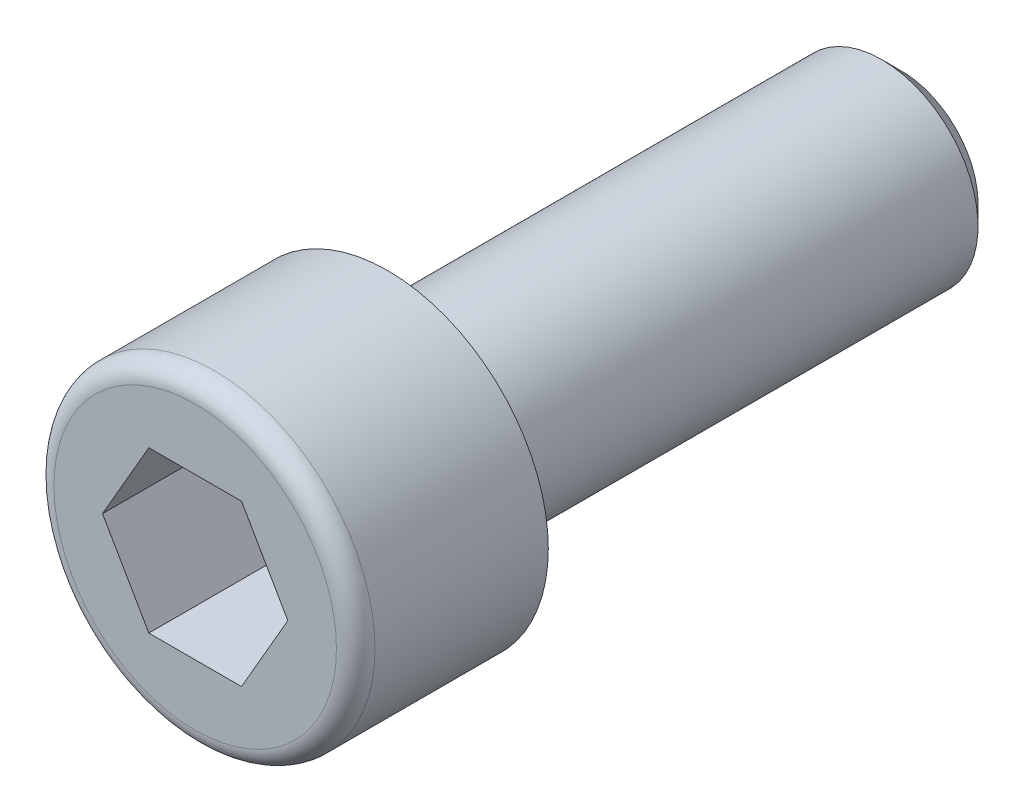
ISO-10303-21;
HEADER;
FILE_DESCRIPTION(('STEP AP214'),'2;1');
FILE_NAME('part.step','',(''),(''),'','','');
FILE_SCHEMA(('AUTOMOTIVE_DESIGN { 1 0 10303 214 1 1 1 1 }'));
ENDSEC;
DATA;
#1=APPLICATION_CONTEXT('core data for automotive mechanical design processes');
#2=APPLICATION_PROTOCOL_DEFINITION('international standard','automotive_design',2000,#1);
#3=PRODUCT_CONTEXT('',#1,'mechanical');
#4=PRODUCT('Part','Part','',(#3));
#5=PRODUCT_RELATED_PRODUCT_CATEGORY('part','',(#4));
#6=PRODUCT_DEFINITION_FORMATION('','',#4);
#7=PRODUCT_DEFINITION_CONTEXT('part definition',#1,'design');
#8=PRODUCT_DEFINITION('design','',#6,#7);
#9=PRODUCT_DEFINITION_SHAPE('','',#8);
#10=(LENGTH_UNIT() NAMED_UNIT(*) SI_UNIT(.MILLI.,.METRE.));
#11=(NAMED_UNIT(*) PLANE_ANGLE_UNIT() SI_UNIT($,.RADIAN.));
#12=(NAMED_UNIT(*) SI_UNIT($,.STERADIAN.) SOLID_ANGLE_UNIT());
#13=UNCERTAINTY_MEASURE_WITH_UNIT(LENGTH_MEASURE(1.E-05),#10,'distance_accuracy_value','');
#14=(GEOMETRIC_REPRESENTATION_CONTEXT(3) GLOBAL_UNCERTAINTY_ASSIGNED_CONTEXT((#13)) GLOBAL_UNIT_ASSIGNED_CONTEXT((#10,
#11,#12)) REPRESENTATION_CONTEXT('',''));
#15=CARTESIAN_POINT('',(0.,0.,0.));
#16=DIRECTION('',(0.,0.,1.));
#17=DIRECTION('',(1.,0.,0.));
#18=AXIS2_PLACEMENT_3D('',#15,#16,#17);
#19=CARTESIAN_POINT('',(0.,0.,1.34877823011767));
#20=DIRECTION('',(0.,0.,-1.));
#21=DIRECTION('',(0.,1.,0.));
#22=AXIS2_PLACEMENT_3D('',#19,#20,#21);
#23=PLANE('',#22);
#24=DIRECTION('',(0.500000000000001,-0.866025403784438,0.));
#25=VECTOR('',#24,1.);
#26=CARTESIAN_POINT('',(2.1650635094611,1.25,1.34877823011767));
#27=LINE('',#26,#25);
#28=CARTESIAN_POINT('',(1.44337567297406,2.5,1.34877823011767));
#29=VERTEX_POINT('',#28);
#30=CARTESIAN_POINT('',(2.88675134594813,0.,1.34877823011767));
#31=VERTEX_POINT('',#30);
#32=EDGE_CURVE('E72',#29,#31,#27,.T.);
#33=ORIENTED_EDGE('',*,*,#32,.F.);
#34=DIRECTION('',(1.,0.,0.));
#35=VECTOR('',#34,1.);
#36=CARTESIAN_POINT('',(0.,2.5,1.34877823011767));
#37=LINE('',#36,#35);
#38=CARTESIAN_POINT('',(-1.44337567297406,2.5,1.34877823011767));
#39=VERTEX_POINT('',#38);
#40=EDGE_CURVE('E221',#39,#29,#37,.T.);
#41=ORIENTED_EDGE('',*,*,#40,.F.);
#42=DIRECTION('',(0.5,0.866025403784439,0.));
#43=VECTOR('',#42,1.);
#44=CARTESIAN_POINT('',(-2.1650635094611,1.25,1.34877823011767));
#45=LINE('',#44,#43);
#46=CARTESIAN_POINT('',(-2.88675134594813,0.,1.34877823011767));
#47=VERTEX_POINT('',#46);
#48=EDGE_CURVE('E224',#47,#39,#45,.T.);
#49=ORIENTED_EDGE('',*,*,#48,.F.);
#50=DIRECTION('',(-0.500000000000001,0.866025403784438,0.));
#51=VECTOR('',#50,1.);
#52=CARTESIAN_POINT('',(-2.1650635094611,-1.25,1.34877823011767));
#53=LINE('',#52,#51);
#54=CARTESIAN_POINT('',(-1.44337567297406,-2.5,1.34877823011767));
#55=VERTEX_POINT('',#54);
#56=EDGE_CURVE('E229',#55,#47,#53,.T.);
#57=ORIENTED_EDGE('',*,*,#56,.F.);
#58=DIRECTION('',(1.,0.,0.));
#59=VECTOR('',#58,1.);
#60=CARTESIAN_POINT('',(0.,-2.5,1.34877823011767));
#61=LINE('',#60,#59);
#62=CARTESIAN_POINT('',(1.44337567297406,-2.5,1.34877823011767));
#63=VERTEX_POINT('',#62);
#64=EDGE_CURVE('E83',#63,#55,#61,.F.);
#65=ORIENTED_EDGE('',*,*,#64,.F.);
#66=DIRECTION('',(-0.5,-0.866025403784439,0.));
#67=VECTOR('',#66,1.);
#68=CARTESIAN_POINT('',(2.1650635094611,-1.25,1.34877823011767));
#69=LINE('',#68,#67);
#70=EDGE_CURVE('E67',#31,#63,#69,.T.);
#71=ORIENTED_EDGE('',*,*,#70,.F.);
#72=EDGE_LOOP('',(#33,#41,#49,#57,#65,#71));
#73=FACE_BOUND('',#72,.T.);
#74=ADVANCED_FACE('F17',(#73),#23,.F.);
#75=CARTESIAN_POINT('',(2.1650635094611,1.25,3.67438911505884));
#76=DIRECTION('',(-0.866025403784438,-0.500000000000001,0.));
#77=DIRECTION('',(0.500000000000001,-0.866025403784438,0.));
#78=AXIS2_PLACEMENT_3D('',#75,#76,#77);
#79=PLANE('',#78);
#80=DIRECTION('',(0.,0.,1.));
#81=VECTOR('',#80,1.);
#82=CARTESIAN_POINT('',(2.88675134594813,0.,3.67438911505883));
#83=LINE('',#82,#81);
#84=CARTESIAN_POINT('',(2.88675134594813,0.,6.));
#85=VERTEX_POINT('',#84);
#86=EDGE_CURVE('E74',#85,#31,#83,.F.);
#87=ORIENTED_EDGE('',*,*,#86,.F.);
#88=DIRECTION('',(0.5,-0.866025403784439,0.));
#89=VECTOR('',#88,1.);
#90=CARTESIAN_POINT('',(1.44337567297406,2.5,6.));
#91=LINE('',#90,#89);
#92=CARTESIAN_POINT('',(1.44337567297406,2.5,6.));
#93=VERTEX_POINT('',#92);
#94=EDGE_CURVE('E210',#93,#85,#91,.T.);
#95=ORIENTED_EDGE('',*,*,#94,.F.);
#96=DIRECTION('',(0.,0.,-1.));
#97=VECTOR('',#96,1.);
#98=CARTESIAN_POINT('',(1.44337567297406,2.5,3.67438911505884));
#99=LINE('',#98,#97);
#100=EDGE_CURVE('E77',#29,#93,#99,.F.);
#101=ORIENTED_EDGE('',*,*,#100,.F.);
#102=ORIENTED_EDGE('',*,*,#32,.T.);
#103=EDGE_LOOP('',(#87,#95,#101,#102));
#104=FACE_BOUND('',#103,.T.);
#105=ADVANCED_FACE('F73',(#104),#79,.T.);
#106=CARTESIAN_POINT('',(2.1650635094611,-1.25,3.67438911505883));
#107=DIRECTION('',(-0.866025403784439,0.5,0.));
#108=DIRECTION('',(-0.5,-0.866025403784439,0.));
#109=AXIS2_PLACEMENT_3D('',#106,#107,#108);
#110=PLANE('',#109);
#111=DIRECTION('',(0.,0.,1.));
#112=VECTOR('',#111,1.);
#113=CARTESIAN_POINT('',(1.44337567297406,-2.5,3.67438911505884));
#114=LINE('',#113,#112);
#115=CARTESIAN_POINT('',(1.44337567297407,-2.5,6.));
#116=VERTEX_POINT('',#115);
#117=EDGE_CURVE('E85',#116,#63,#114,.F.);
#118=ORIENTED_EDGE('',*,*,#117,.F.);
#119=DIRECTION('',(-0.5,-0.866025403784439,0.));
#120=VECTOR('',#119,1.);
#121=CARTESIAN_POINT('',(2.88675134594813,0.,6.));
#122=LINE('',#121,#120);
#123=EDGE_CURVE('E89',#85,#116,#122,.T.);
#124=ORIENTED_EDGE('',*,*,#123,.F.);
#125=ORIENTED_EDGE('',*,*,#86,.T.);
#126=ORIENTED_EDGE('',*,*,#70,.T.);
#127=EDGE_LOOP('',(#118,#124,#125,#126));
#128=FACE_BOUND('',#127,.T.);
#129=ADVANCED_FACE('F87',(#128),#110,.T.);
#130=CARTESIAN_POINT('',(0.,-2.5,3.67438911505884));
#131=DIRECTION('',(0.,1.,0.));
#132=DIRECTION('',(0.,0.,1.));
#133=AXIS2_PLACEMENT_3D('',#130,#131,#132);
#134=PLANE('',#133);
#135=DIRECTION('',(0.,0.,1.));
#136=VECTOR('',#135,1.);
#137=CARTESIAN_POINT('',(-1.44337567297406,-2.5,3.67438911505884));
#138=LINE('',#137,#136);
#139=CARTESIAN_POINT('',(-1.44337567297406,-2.5,6.));
#140=VERTEX_POINT('',#139);
#141=EDGE_CURVE('E231',#140,#55,#138,.F.);
#142=ORIENTED_EDGE('',*,*,#141,.F.);
#143=DIRECTION('',(1.,0.,0.));
#144=VECTOR('',#143,1.);
#145=CARTESIAN_POINT('',(0.,-2.5,6.));
#146=LINE('',#145,#144);
#147=EDGE_CURVE('E236',#116,#140,#146,.F.);
#148=ORIENTED_EDGE('',*,*,#147,.F.);
#149=ORIENTED_EDGE('',*,*,#117,.T.);
#150=ORIENTED_EDGE('',*,*,#64,.T.);
#151=EDGE_LOOP('',(#142,#148,#149,#150));
#152=FACE_BOUND('',#151,.T.);
#153=ADVANCED_FACE('F149',(#152),#134,.T.);
#154=CARTESIAN_POINT('',(-2.1650635094611,-1.25,3.67438911505884));
#155=DIRECTION('',(0.866025403784438,0.500000000000001,0.));
#156=DIRECTION('',(-0.500000000000001,0.866025403784438,0.));
#157=AXIS2_PLACEMENT_3D('',#154,#155,#156);
#158=PLANE('',#157);
#159=DIRECTION('',(0.,0.,1.));
#160=VECTOR('',#159,1.);
#161=CARTESIAN_POINT('',(-2.88675134594813,0.,3.67438911505884));
#162=LINE('',#161,#160);
#163=CARTESIAN_POINT('',(-2.88675134594813,0.,6.));
#164=VERTEX_POINT('',#163);
#165=EDGE_CURVE('E226',#164,#47,#162,.F.);
#166=ORIENTED_EDGE('',*,*,#165,.F.);
#167=DIRECTION('',(-0.5,0.866025403784439,0.));
#168=VECTOR('',#167,1.);
#169=CARTESIAN_POINT('',(-1.44337567297406,-2.5,6.));
#170=LINE('',#169,#168);
#171=EDGE_CURVE('E240',#140,#164,#170,.T.);
#172=ORIENTED_EDGE('',*,*,#171,.F.);
#173=ORIENTED_EDGE('',*,*,#141,.T.);
#174=ORIENTED_EDGE('',*,*,#56,.T.);
#175=EDGE_LOOP('',(#166,#172,#173,#174));
#176=FACE_BOUND('',#175,.T.);
#177=ADVANCED_FACE('F146',(#176),#158,.T.);
#178=CARTESIAN_POINT('',(-2.1650635094611,1.25,3.67438911505884));
#179=DIRECTION('',(0.866025403784439,-0.5,0.));
#180=DIRECTION('',(0.5,0.866025403784439,0.));
#181=AXIS2_PLACEMENT_3D('',#178,#179,#180);
#182=PLANE('',#181);
#183=DIRECTION('',(0.,0.,-1.));
#184=VECTOR('',#183,1.);
#185=CARTESIAN_POINT('',(-1.44337567297406,2.5,3.67438911505884));
#186=LINE('',#185,#184);
#187=CARTESIAN_POINT('',(-1.44337567297406,2.5,6.));
#188=VERTEX_POINT('',#187);
#189=EDGE_CURVE('E35',#188,#39,#186,.T.);
#190=ORIENTED_EDGE('',*,*,#189,.F.);
#191=DIRECTION('',(0.499999999999999,0.866025403784439,0.));
#192=VECTOR('',#191,1.);
#193=CARTESIAN_POINT('',(-2.88675134594813,0.,6.));
#194=LINE('',#193,#192);
#195=EDGE_CURVE('E245',#164,#188,#194,.T.);
#196=ORIENTED_EDGE('',*,*,#195,.F.);
#197=ORIENTED_EDGE('',*,*,#165,.T.);
#198=ORIENTED_EDGE('',*,*,#48,.T.);
#199=EDGE_LOOP('',(#190,#196,#197,#198));
#200=FACE_BOUND('',#199,.T.);
#201=ADVANCED_FACE('F142',(#200),#182,.T.);
#202=CARTESIAN_POINT('',(0.,2.5,3.67438911505884));
#203=DIRECTION('',(0.,-1.,0.));
#204=DIRECTION('',(0.,0.,-1.));
#205=AXIS2_PLACEMENT_3D('',#202,#203,#204);
#206=PLANE('',#205);
#207=ORIENTED_EDGE('',*,*,#100,.T.);
#208=DIRECTION('',(1.,0.,0.));
#209=VECTOR('',#208,1.);
#210=CARTESIAN_POINT('',(0.,2.5,6.));
#211=LINE('',#210,#209);
#212=EDGE_CURVE('E114',#188,#93,#211,.T.);
#213=ORIENTED_EDGE('',*,*,#212,.F.);
#214=ORIENTED_EDGE('',*,*,#189,.T.);
#215=ORIENTED_EDGE('',*,*,#40,.T.);
#216=EDGE_LOOP('',(#207,#213,#214,#215));
#217=FACE_BOUND('',#216,.T.);
#218=ADVANCED_FACE('F137',(#217),#206,.T.);
#219=CARTESIAN_POINT('',(0.,0.,6.));
#220=DIRECTION('',(0.,0.,1.));
#221=DIRECTION('',(0.,-1.,0.));
#222=AXIS2_PLACEMENT_3D('',#219,#220,#221);
#223=PLANE('',#222);
#224=CARTESIAN_POINT('',(0.,0.,6.));
#225=DIRECTION('',(0.,0.,-1.));
#226=DIRECTION('',(1.,0.,0.));
#227=AXIS2_PLACEMENT_3D('',#224,#225,#226);
#228=CIRCLE('',#227,4.4);
#229=CARTESIAN_POINT('',(4.4,0.,6.));
#230=VERTEX_POINT('',#229);
#231=EDGE_CURVE('E109',#230,#230,#228,.T.);
#232=ORIENTED_EDGE('',*,*,#231,.F.);
#233=EDGE_LOOP('',(#232));
#234=FACE_BOUND('',#233,.T.);
#235=ORIENTED_EDGE('',*,*,#195,.T.);
#236=ORIENTED_EDGE('',*,*,#212,.T.);
#237=ORIENTED_EDGE('',*,*,#94,.T.);
#238=ORIENTED_EDGE('',*,*,#123,.T.);
#239=ORIENTED_EDGE('',*,*,#147,.T.);
#240=ORIENTED_EDGE('',*,*,#171,.T.);
#241=EDGE_LOOP('',(#235,#236,#237,#238,#239,#240));
#242=FACE_BOUND('',#241,.T.);
#243=ADVANCED_FACE('F126',(#234,#242),#223,.T.);
#244=CARTESIAN_POINT('',(0.,0.,5.4));
#245=DIRECTION('',(0.,0.,-1.));
#246=DIRECTION('',(1.,0.,0.));
#247=AXIS2_PLACEMENT_3D('',#244,#245,#246);
#248=TOROIDAL_SURFACE('',#247,4.4,0.6);
#249=CARTESIAN_POINT('',(0.,0.,5.4));
#250=DIRECTION('',(0.,0.,-1.));
#251=DIRECTION('',(0.,1.,0.));
#252=AXIS2_PLACEMENT_3D('',#249,#250,#251);
#253=CIRCLE('',#252,5.);
#254=CARTESIAN_POINT('',(0.,5.,5.4));
#255=VERTEX_POINT('',#254);
#256=EDGE_CURVE('E105',#255,#255,#253,.T.);
#257=ORIENTED_EDGE('',*,*,#256,.F.);
#258=EDGE_LOOP('',(#257));
#259=FACE_BOUND('',#258,.T.);
#260=ORIENTED_EDGE('',*,*,#231,.T.);
#261=EDGE_LOOP('',(#260));
#262=FACE_BOUND('',#261,.T.);
#263=ADVANCED_FACE('F136',(#259,#262),#248,.T.);
#264=CARTESIAN_POINT('',(0.,0.,2.7));
#265=DIRECTION('',(0.,0.,-1.));
#266=DIRECTION('',(0.,1.,0.));
#267=AXIS2_PLACEMENT_3D('',#264,#265,#266);
#268=CYLINDRICAL_SURFACE('',#267,5.);
#269=CARTESIAN_POINT('',(0.,0.,0.));
#270=DIRECTION('',(0.,0.,-1.));
#271=DIRECTION('',(0.,1.,0.));
#272=AXIS2_PLACEMENT_3D('',#269,#270,#271);
#273=CIRCLE('',#272,5.);
#274=CARTESIAN_POINT('',(0.,5.,0.));
#275=VERTEX_POINT('',#274);
#276=EDGE_CURVE('E20',#275,#275,#273,.T.);
#277=ORIENTED_EDGE('',*,*,#276,.F.);
#278=EDGE_LOOP('',(#277));
#279=FACE_BOUND('',#278,.T.);
#280=ORIENTED_EDGE('',*,*,#256,.T.);
#281=EDGE_LOOP('',(#280));
#282=FACE_BOUND('',#281,.T.);
#283=ADVANCED_FACE('F197',(#279,#282),#268,.T.);
#284=CARTESIAN_POINT('',(0.,0.,0.));
#285=DIRECTION('',(0.,0.,-1.));
#286=DIRECTION('',(0.,1.,0.));
#287=AXIS2_PLACEMENT_3D('',#284,#285,#286);
#288=PLANE('',#287);
#289=ORIENTED_EDGE('',*,*,#276,.T.);
#290=EDGE_LOOP('',(#289));
#291=FACE_BOUND('',#290,.T.);
#292=CARTESIAN_POINT('',(0.,0.,0.));
#293=DIRECTION('',(0.,0.,-1.));
#294=DIRECTION('',(1.,0.,0.));
#295=AXIS2_PLACEMENT_3D('',#292,#293,#294);
#296=CIRCLE('',#295,3.25);
#297=CARTESIAN_POINT('',(3.25,0.,0.));
#298=VERTEX_POINT('',#297);
#299=EDGE_CURVE('E95',#298,#298,#296,.F.);
#300=ORIENTED_EDGE('',*,*,#299,.T.);
#301=EDGE_LOOP('',(#300));
#302=FACE_BOUND('',#301,.T.);
#303=ADVANCED_FACE('F189',(#291,#302),#288,.T.);
#304=CARTESIAN_POINT('',(0.,0.,-16.));
#305=DIRECTION('',(0.,0.,1.));
#306=DIRECTION('',(0.,-1.,0.));
#307=AXIS2_PLACEMENT_3D('',#304,#305,#306);
#308=PLANE('',#307);
#309=CARTESIAN_POINT('',(0.,0.,-16.0000000000196));
#310=DIRECTION('',(0.,0.,1.));
#311=DIRECTION('',(0.,-1.,0.));
#312=AXIS2_PLACEMENT_3D('',#309,#310,#311);
#313=CIRCLE('',#312,2.38655000003973);
#314=CARTESIAN_POINT('',(0.,-2.38655000003974,-16.0000000000196));
#315=VERTEX_POINT('',#314);
#316=EDGE_CURVE('E93',#315,#315,#313,.T.);
#317=ORIENTED_EDGE('',*,*,#316,.F.);
#318=EDGE_LOOP('',(#317));
#319=FACE_BOUND('',#318,.T.);
#320=ADVANCED_FACE('F180',(#319),#308,.F.);
#321=CARTESIAN_POINT('',(0.,0.,-0.25));
#322=DIRECTION('',(0.,0.,-1.));
#323=DIRECTION('',(1.,0.,0.));
#324=AXIS2_PLACEMENT_3D('',#321,#322,#323);
#325=TOROIDAL_SURFACE('',#324,3.25,0.25);
#326=ORIENTED_EDGE('',*,*,#299,.F.);
#327=EDGE_LOOP('',(#326));
#328=FACE_BOUND('',#327,.T.);
#329=CARTESIAN_POINT('',(0.,0.,-0.25));
#330=DIRECTION('',(0.,0.,-1.));
#331=DIRECTION('',(0.,1.,0.));
#332=AXIS2_PLACEMENT_3D('',#329,#330,#331);
#333=CIRCLE('',#332,3.);
#334=CARTESIAN_POINT('',(0.,3.,-0.250000000000001));
#335=VERTEX_POINT('',#334);
#336=EDGE_CURVE('E26',#335,#335,#333,.T.);
#337=ORIENTED_EDGE('',*,*,#336,.F.);
#338=EDGE_LOOP('',(#337));
#339=FACE_BOUND('',#338,.T.);
#340=ADVANCED_FACE('F169',(#328,#339),#325,.F.);
#341=CARTESIAN_POINT('',(0.,0.,-15.3865500000734));
#342=DIRECTION('',(0.,0.,1.));
#343=DIRECTION('',(0.,-1.,0.));
#344=AXIS2_PLACEMENT_3D('',#341,#342,#343);
#345=CONICAL_SURFACE('',#344,2.9999999999859,0.785398163397448);
#346=ORIENTED_EDGE('',*,*,#316,.T.);
#347=EDGE_LOOP('',(#346));
#348=FACE_BOUND('',#347,.T.);
#349=CARTESIAN_POINT('',(0.,0.,-15.38655));
#350=DIRECTION('',(0.,0.,-1.));
#351=DIRECTION('',(0.,1.,0.));
#352=AXIS2_PLACEMENT_3D('',#349,#350,#351);
#353=CIRCLE('',#352,3.);
#354=CARTESIAN_POINT('',(0.,3.,-15.38655));
#355=VERTEX_POINT('',#354);
#356=EDGE_CURVE('E11',#355,#355,#353,.F.);
#357=ORIENTED_EDGE('',*,*,#356,.F.);
#358=EDGE_LOOP('',(#357));
#359=FACE_BOUND('',#358,.T.);
#360=ADVANCED_FACE('F162',(#348,#359),#345,.T.);
#361=CARTESIAN_POINT('',(0.,0.,-7.693275));
#362=DIRECTION('',(0.,0.,-1.));
#363=DIRECTION('',(0.,1.,0.));
#364=AXIS2_PLACEMENT_3D('',#361,#362,#363);
#365=CYLINDRICAL_SURFACE('',#364,3.);
#366=ORIENTED_EDGE('',*,*,#336,.T.);
#367=EDGE_LOOP('',(#366));
#368=FACE_BOUND('',#367,.T.);
#369=ORIENTED_EDGE('',*,*,#356,.T.);
#370=EDGE_LOOP('',(#369));
#371=FACE_BOUND('',#370,.T.);
#372=ADVANCED_FACE('F160',(#368,#371),#365,.T.);
#373=CLOSED_SHELL('',(#74,#105,#129,#153,#177,#201,#218,#243,#263,#283,#303,#320,#340,#360,#372));
#374=CARTESIAN_POINT('',(0.,0.,0.));
#375=DIRECTION('',(0.,0.,-1.));
#376=DIRECTION('',(1.,0.,0.));
#377=AXIS2_PLACEMENT_3D('',#374,#375,#376);
#378=TOROIDAL_SURFACE('',#377,3.,0.06);
#379=ADVANCED_FACE('F173',(),#378,.F.);
#380=CLOSED_SHELL('',(#379));
#381=ORIENTED_CLOSED_SHELL('',*,#380,.T.);
#382=BREP_WITH_VOIDS('B1',#373,(#381));
#383=ADVANCED_BREP_SHAPE_REPRESENTATION('',(#18,#382),#14);
#384=SHAPE_DEFINITION_REPRESENTATION(#9,#383);
ENDSEC;
END-ISO-10303-21;
